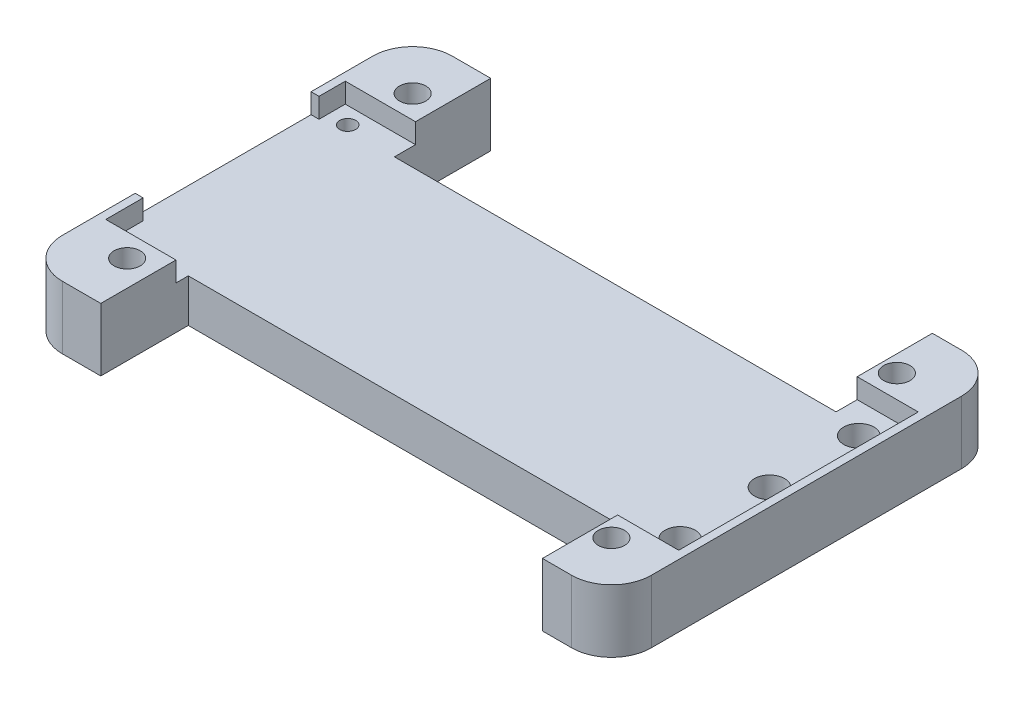
ISO-10303-21;
HEADER;
FILE_DESCRIPTION(('STEP AP214'),'2;1');
FILE_NAME('part.step','',(''),(''),'','','');
FILE_SCHEMA(('AUTOMOTIVE_DESIGN { 1 0 10303 214 1 1 1 1 }'));
ENDSEC;
DATA;
#1=APPLICATION_CONTEXT('core data for automotive mechanical design processes');
#2=APPLICATION_PROTOCOL_DEFINITION('international standard','automotive_design',2000,#1);
#3=PRODUCT_CONTEXT('',#1,'mechanical');
#4=PRODUCT('Part','Part','',(#3));
#5=PRODUCT_RELATED_PRODUCT_CATEGORY('part','',(#4));
#6=PRODUCT_DEFINITION_FORMATION('','',#4);
#7=PRODUCT_DEFINITION_CONTEXT('part definition',#1,'design');
#8=PRODUCT_DEFINITION('design','',#6,#7);
#9=PRODUCT_DEFINITION_SHAPE('','',#8);
#10=(LENGTH_UNIT() NAMED_UNIT(*) SI_UNIT(.MILLI.,.METRE.));
#11=(NAMED_UNIT(*) PLANE_ANGLE_UNIT() SI_UNIT($,.RADIAN.));
#12=(NAMED_UNIT(*) SI_UNIT($,.STERADIAN.) SOLID_ANGLE_UNIT());
#13=UNCERTAINTY_MEASURE_WITH_UNIT(LENGTH_MEASURE(1.E-05),#10,'distance_accuracy_value','');
#14=(GEOMETRIC_REPRESENTATION_CONTEXT(3) GLOBAL_UNCERTAINTY_ASSIGNED_CONTEXT((#13)) GLOBAL_UNIT_ASSIGNED_CONTEXT((#10,
#11,#12)) REPRESENTATION_CONTEXT('',''));
#15=CARTESIAN_POINT('',(0.,0.,0.));
#16=DIRECTION('',(0.,0.,1.));
#17=DIRECTION('',(1.,0.,0.));
#18=AXIS2_PLACEMENT_3D('',#15,#16,#17);
#19=CARTESIAN_POINT('',(-37.,7.9,24.5));
#20=DIRECTION('',(0.,0.,-1.));
#21=DIRECTION('',(-1.,0.,0.));
#22=AXIS2_PLACEMENT_3D('',#19,#20,#21);
#23=PLANE('',#22);
#24=DIRECTION('',(1.,0.,0.));
#25=VECTOR('',#24,1.);
#26=CARTESIAN_POINT('',(-37.,7.9,24.5));
#27=LINE('',#26,#25);
#28=CARTESIAN_POINT('',(28.324,7.9,24.5));
#29=VERTEX_POINT('',#28);
#30=CARTESIAN_POINT('',(32.,7.9,24.5));
#31=VERTEX_POINT('',#30);
#32=EDGE_CURVE('E261',#29,#31,#27,.T.);
#33=ORIENTED_EDGE('',*,*,#32,.F.);
#34=DIRECTION('',(0.,1.,0.));
#35=VECTOR('',#34,1.);
#36=CARTESIAN_POINT('',(28.324,-2.1,24.5));
#37=LINE('',#36,#35);
#38=CARTESIAN_POINT('',(28.324,0.,24.5));
#39=VERTEX_POINT('',#38);
#40=EDGE_CURVE('E254',#39,#29,#37,.T.);
#41=ORIENTED_EDGE('',*,*,#40,.F.);
#42=DIRECTION('',(1.,0.,0.));
#43=VECTOR('',#42,1.);
#44=CARTESIAN_POINT('',(-37.,0.,24.5));
#45=LINE('',#44,#43);
#46=CARTESIAN_POINT('',(32.,0.,24.5));
#47=VERTEX_POINT('',#46);
#48=EDGE_CURVE('E285',#39,#47,#45,.T.);
#49=ORIENTED_EDGE('',*,*,#48,.T.);
#50=DIRECTION('',(0.,-1.,0.));
#51=VECTOR('',#50,1.);
#52=CARTESIAN_POINT('',(32.,7.9,24.5));
#53=LINE('',#52,#51);
#54=EDGE_CURVE('E309',#47,#31,#53,.F.);
#55=ORIENTED_EDGE('',*,*,#54,.T.);
#56=EDGE_LOOP('',(#33,#41,#49,#55));
#57=FACE_BOUND('',#56,.T.);
#58=ADVANCED_FACE('F45',(#57),#23,.F.);
#59=CARTESIAN_POINT('',(0.,7.9,0.));
#60=DIRECTION('',(0.,-1.,0.));
#61=DIRECTION('',(0.,0.,-1.));
#62=AXIS2_PLACEMENT_3D('',#59,#60,#61);
#63=PLANE('',#62);
#64=CARTESIAN_POINT('',(30.424,7.9,17.9375));
#65=DIRECTION('',(0.,1.,0.));
#66=DIRECTION('',(0.,0.,1.));
#67=AXIS2_PLACEMENT_3D('',#64,#65,#66);
#68=CIRCLE('',#67,1.65);
#69=CARTESIAN_POINT('',(30.424,7.9,19.5875));
#70=VERTEX_POINT('',#69);
#71=EDGE_CURVE('E468',#70,#70,#68,.T.);
#72=ORIENTED_EDGE('',*,*,#71,.F.);
#73=EDGE_LOOP('',(#72));
#74=FACE_BOUND('',#73,.T.);
#75=CARTESIAN_POINT('',(30.424,7.9,-17.9375));
#76=DIRECTION('',(0.,1.,0.));
#77=DIRECTION('',(0.,0.,1.));
#78=AXIS2_PLACEMENT_3D('',#75,#76,#77);
#79=CIRCLE('',#78,1.65);
#80=CARTESIAN_POINT('',(30.424,7.9,-16.2875));
#81=VERTEX_POINT('',#80);
#82=EDGE_CURVE('E476',#81,#81,#79,.T.);
#83=ORIENTED_EDGE('',*,*,#82,.F.);
#84=EDGE_LOOP('',(#83));
#85=FACE_BOUND('',#84,.T.);
#86=DIRECTION('',(0.,0.,-1.));
#87=VECTOR('',#86,1.);
#88=CARTESIAN_POINT('',(28.324,7.9,13.5));
#89=LINE('',#88,#87);
#90=CARTESIAN_POINT('',(28.324,7.9,15.05));
#91=VERTEX_POINT('',#90);
#92=EDGE_CURVE('E61',#29,#91,#89,.T.);
#93=ORIENTED_EDGE('',*,*,#92,.F.);
#94=ORIENTED_EDGE('',*,*,#32,.T.);
#95=CARTESIAN_POINT('',(32.,7.9,19.5));
#96=DIRECTION('',(0.,-1.,0.));
#97=DIRECTION('',(0.,0.,-1.));
#98=AXIS2_PLACEMENT_3D('',#95,#96,#97);
#99=CIRCLE('',#98,5.);
#100=CARTESIAN_POINT('',(37.,7.9,19.5));
#101=VERTEX_POINT('',#100);
#102=EDGE_CURVE('E321',#31,#101,#99,.F.);
#103=ORIENTED_EDGE('',*,*,#102,.T.);
#104=DIRECTION('',(0.,0.,-1.));
#105=VECTOR('',#104,1.);
#106=CARTESIAN_POINT('',(37.,7.9,24.5));
#107=LINE('',#106,#105);
#108=CARTESIAN_POINT('',(37.,7.9,-19.5));
#109=VERTEX_POINT('',#108);
#110=EDGE_CURVE('E287',#101,#109,#107,.T.);
#111=ORIENTED_EDGE('',*,*,#110,.T.);
#112=CARTESIAN_POINT('',(32.,7.9,-19.5));
#113=DIRECTION('',(0.,-1.,0.));
#114=DIRECTION('',(0.,0.,-1.));
#115=AXIS2_PLACEMENT_3D('',#112,#113,#114);
#116=CIRCLE('',#115,5.);
#117=CARTESIAN_POINT('',(32.,7.9,-24.5));
#118=VERTEX_POINT('',#117);
#119=EDGE_CURVE('E318',#109,#118,#116,.F.);
#120=ORIENTED_EDGE('',*,*,#119,.T.);
#121=DIRECTION('',(-1.,0.,0.));
#122=VECTOR('',#121,1.);
#123=CARTESIAN_POINT('',(-37.,7.9,-24.5));
#124=LINE('',#123,#122);
#125=CARTESIAN_POINT('',(28.324,7.9,-24.5));
#126=VERTEX_POINT('',#125);
#127=EDGE_CURVE('E501',#118,#126,#124,.T.);
#128=ORIENTED_EDGE('',*,*,#127,.T.);
#129=DIRECTION('',(0.,0.,-1.));
#130=VECTOR('',#129,1.);
#131=CARTESIAN_POINT('',(28.324,7.9,-24.5));
#132=LINE('',#131,#130);
#133=CARTESIAN_POINT('',(28.324,7.9,-15.05));
#134=VERTEX_POINT('',#133);
#135=EDGE_CURVE('E584',#134,#126,#132,.T.);
#136=ORIENTED_EDGE('',*,*,#135,.F.);
#137=DIRECTION('',(-1.,0.,0.));
#138=VECTOR('',#137,1.);
#139=CARTESIAN_POINT('',(-36.,7.9,-15.05));
#140=LINE('',#139,#138);
#141=CARTESIAN_POINT('',(36.,7.9,-15.05));
#142=VERTEX_POINT('',#141);
#143=EDGE_CURVE('E387',#142,#134,#140,.T.);
#144=ORIENTED_EDGE('',*,*,#143,.F.);
#145=DIRECTION('',(0.,0.,-1.));
#146=VECTOR('',#145,1.);
#147=CARTESIAN_POINT('',(36.,7.9,-15.05));
#148=LINE('',#147,#146);
#149=CARTESIAN_POINT('',(36.,7.9,15.05));
#150=VERTEX_POINT('',#149);
#151=EDGE_CURVE('E410',#150,#142,#148,.T.);
#152=ORIENTED_EDGE('',*,*,#151,.F.);
#153=DIRECTION('',(1.,0.,0.));
#154=VECTOR('',#153,1.);
#155=CARTESIAN_POINT('',(-36.,7.9,15.05));
#156=LINE('',#155,#154);
#157=EDGE_CURVE('E407',#91,#150,#156,.T.);
#158=ORIENTED_EDGE('',*,*,#157,.F.);
#159=EDGE_LOOP('',(#93,#94,#103,#111,#120,#128,#136,#144,#152,#158));
#160=FACE_BOUND('',#159,.T.);
#161=ADVANCED_FACE('F633',(#74,#85,#160),#63,.F.);
#162=CARTESIAN_POINT('',(-36.,5.4,15.05));
#163=DIRECTION('',(0.,0.,1.));
#164=DIRECTION('',(1.,0.,0.));
#165=AXIS2_PLACEMENT_3D('',#162,#163,#164);
#166=PLANE('',#165);
#167=CARTESIAN_POINT('',(-36.,7.9,15.05));
#168=VERTEX_POINT('',#167);
#169=CARTESIAN_POINT('',(-27.176,7.9,15.05));
#170=VERTEX_POINT('',#169);
#171=EDGE_CURVE('E366',#168,#170,#156,.T.);
#172=ORIENTED_EDGE('',*,*,#171,.T.);
#173=DIRECTION('',(0.,-1.,0.));
#174=VECTOR('',#173,1.);
#175=CARTESIAN_POINT('',(-27.176,5.4,15.05));
#176=LINE('',#175,#174);
#177=CARTESIAN_POINT('',(-27.176,5.4,15.05));
#178=VERTEX_POINT('',#177);
#179=EDGE_CURVE('E54',#170,#178,#176,.T.);
#180=ORIENTED_EDGE('',*,*,#179,.T.);
#181=DIRECTION('',(1.,0.,0.));
#182=VECTOR('',#181,1.);
#183=CARTESIAN_POINT('',(-36.,5.4,15.05));
#184=LINE('',#183,#182);
#185=CARTESIAN_POINT('',(-36.,5.4,15.05));
#186=VERTEX_POINT('',#185);
#187=EDGE_CURVE('E364',#186,#178,#184,.T.);
#188=ORIENTED_EDGE('',*,*,#187,.F.);
#189=DIRECTION('',(0.,1.,0.));
#190=VECTOR('',#189,1.);
#191=CARTESIAN_POINT('',(-36.,5.4,15.05));
#192=LINE('',#191,#190);
#193=EDGE_CURVE('E421',#186,#168,#192,.T.);
#194=ORIENTED_EDGE('',*,*,#193,.T.);
#195=EDGE_LOOP('',(#172,#180,#188,#194));
#196=FACE_BOUND('',#195,.T.);
#197=ADVANCED_FACE('F363',(#196),#166,.F.);
#198=CARTESIAN_POINT('',(-37.,7.9,-24.5));
#199=DIRECTION('',(0.,0.,1.));
#200=DIRECTION('',(1.,0.,0.));
#201=AXIS2_PLACEMENT_3D('',#198,#199,#200);
#202=PLANE('',#201);
#203=CARTESIAN_POINT('',(-27.176,7.9,-24.5));
#204=VERTEX_POINT('',#203);
#205=CARTESIAN_POINT('',(-32.,7.9,-24.5));
#206=VERTEX_POINT('',#205);
#207=EDGE_CURVE('E500',#204,#206,#124,.T.);
#208=ORIENTED_EDGE('',*,*,#207,.F.);
#209=DIRECTION('',(0.,1.,0.));
#210=VECTOR('',#209,1.);
#211=CARTESIAN_POINT('',(-27.176,0.,-24.5));
#212=LINE('',#211,#210);
#213=CARTESIAN_POINT('',(-27.176,0.,-24.5));
#214=VERTEX_POINT('',#213);
#215=EDGE_CURVE('E569',#214,#204,#212,.T.);
#216=ORIENTED_EDGE('',*,*,#215,.F.);
#217=DIRECTION('',(-1.,0.,0.));
#218=VECTOR('',#217,1.);
#219=CARTESIAN_POINT('',(-37.,0.,-24.5));
#220=LINE('',#219,#218);
#221=CARTESIAN_POINT('',(-32.,0.,-24.5));
#222=VERTEX_POINT('',#221);
#223=EDGE_CURVE('E275',#214,#222,#220,.T.);
#224=ORIENTED_EDGE('',*,*,#223,.T.);
#225=DIRECTION('',(0.,-1.,0.));
#226=VECTOR('',#225,1.);
#227=CARTESIAN_POINT('',(-32.,7.9,-24.5));
#228=LINE('',#227,#226);
#229=EDGE_CURVE('E324',#222,#206,#228,.F.);
#230=ORIENTED_EDGE('',*,*,#229,.T.);
#231=EDGE_LOOP('',(#208,#216,#224,#230));
#232=FACE_BOUND('',#231,.T.);
#233=ADVANCED_FACE('F522',(#232),#202,.F.);
#234=CARTESIAN_POINT('',(-30.424,7.9,-17.9375));
#235=DIRECTION('',(0.,1.,0.));
#236=DIRECTION('',(0.,0.,1.));
#237=AXIS2_PLACEMENT_3D('',#234,#235,#236);
#238=CIRCLE('',#237,1.65);
#239=CARTESIAN_POINT('',(-30.424,7.9,-16.2875));
#240=VERTEX_POINT('',#239);
#241=EDGE_CURVE('E480',#240,#240,#238,.T.);
#242=ORIENTED_EDGE('',*,*,#241,.F.);
#243=EDGE_LOOP('',(#242));
#244=FACE_BOUND('',#243,.T.);
#245=CARTESIAN_POINT('',(-27.176,7.9,-15.05));
#246=VERTEX_POINT('',#245);
#247=CARTESIAN_POINT('',(-36.,7.9,-15.05));
#248=VERTEX_POINT('',#247);
#249=EDGE_CURVE('E392',#246,#248,#140,.T.);
#250=ORIENTED_EDGE('',*,*,#249,.F.);
#251=DIRECTION('',(0.,0.,1.));
#252=VECTOR('',#251,1.);
#253=CARTESIAN_POINT('',(-27.176,7.9,-24.5));
#254=LINE('',#253,#252);
#255=EDGE_CURVE('E518',#204,#246,#254,.T.);
#256=ORIENTED_EDGE('',*,*,#255,.F.);
#257=ORIENTED_EDGE('',*,*,#207,.T.);
#258=CARTESIAN_POINT('',(-32.,7.9,-19.5));
#259=DIRECTION('',(0.,-1.,0.));
#260=DIRECTION('',(0.,0.,-1.));
#261=AXIS2_PLACEMENT_3D('',#258,#259,#260);
#262=CIRCLE('',#261,5.);
#263=CARTESIAN_POINT('',(-37.,7.9,-19.5));
#264=VERTEX_POINT('',#263);
#265=EDGE_CURVE('E313',#206,#264,#262,.F.);
#266=ORIENTED_EDGE('',*,*,#265,.T.);
#267=DIRECTION('',(0.,0.,1.));
#268=VECTOR('',#267,1.);
#269=CARTESIAN_POINT('',(-37.,7.9,24.5));
#270=LINE('',#269,#268);
#271=CARTESIAN_POINT('',(-37.,7.9,-11.75));
#272=VERTEX_POINT('',#271);
#273=EDGE_CURVE('E267',#264,#272,#270,.T.);
#274=ORIENTED_EDGE('',*,*,#273,.T.);
#275=DIRECTION('',(-1.,0.,0.));
#276=VECTOR('',#275,1.);
#277=CARTESIAN_POINT('',(-36.,7.9,-11.75));
#278=LINE('',#277,#276);
#279=CARTESIAN_POINT('',(-36.,7.9,-11.75));
#280=VERTEX_POINT('',#279);
#281=EDGE_CURVE('E396',#280,#272,#278,.T.);
#282=ORIENTED_EDGE('',*,*,#281,.F.);
#283=DIRECTION('',(0.,0.,1.));
#284=VECTOR('',#283,1.);
#285=CARTESIAN_POINT('',(-36.,7.9,-15.05));
#286=LINE('',#285,#284);
#287=EDGE_CURVE('E391',#248,#280,#286,.T.);
#288=ORIENTED_EDGE('',*,*,#287,.F.);
#289=EDGE_LOOP('',(#250,#256,#257,#266,#274,#282,#288));
#290=FACE_BOUND('',#289,.T.);
#291=ADVANCED_FACE('F514',(#244,#290),#63,.F.);
#292=CARTESIAN_POINT('',(-36.,5.4,-15.05));
#293=DIRECTION('',(0.,0.,-1.));
#294=DIRECTION('',(-1.,0.,0.));
#295=AXIS2_PLACEMENT_3D('',#292,#293,#294);
#296=PLANE('',#295);
#297=DIRECTION('',(-1.,0.,0.));
#298=VECTOR('',#297,1.);
#299=CARTESIAN_POINT('',(-36.,5.4,-15.05));
#300=LINE('',#299,#298);
#301=CARTESIAN_POINT('',(-27.176,5.4,-15.05));
#302=VERTEX_POINT('',#301);
#303=CARTESIAN_POINT('',(-36.,5.4,-15.05));
#304=VERTEX_POINT('',#303);
#305=EDGE_CURVE('E414',#302,#304,#300,.T.);
#306=ORIENTED_EDGE('',*,*,#305,.F.);
#307=DIRECTION('',(0.,1.,0.));
#308=VECTOR('',#307,1.);
#309=CARTESIAN_POINT('',(-27.176,5.4,-15.05));
#310=LINE('',#309,#308);
#311=EDGE_CURVE('E349',#302,#246,#310,.T.);
#312=ORIENTED_EDGE('',*,*,#311,.T.);
#313=ORIENTED_EDGE('',*,*,#249,.T.);
#314=DIRECTION('',(0.,1.,0.));
#315=VECTOR('',#314,1.);
#316=CARTESIAN_POINT('',(-36.,5.4,-15.05));
#317=LINE('',#316,#315);
#318=EDGE_CURVE('E382',#304,#248,#317,.T.);
#319=ORIENTED_EDGE('',*,*,#318,.F.);
#320=EDGE_LOOP('',(#306,#312,#313,#319));
#321=FACE_BOUND('',#320,.T.);
#322=ADVANCED_FACE('F645',(#321),#296,.F.);
#323=CARTESIAN_POINT('',(37.,7.9,24.5));
#324=DIRECTION('',(-1.,0.,0.));
#325=DIRECTION('',(0.,0.,1.));
#326=AXIS2_PLACEMENT_3D('',#323,#324,#325);
#327=PLANE('',#326);
#328=ORIENTED_EDGE('',*,*,#110,.F.);
#329=DIRECTION('',(0.,-1.,0.));
#330=VECTOR('',#329,1.);
#331=CARTESIAN_POINT('',(37.,7.9,19.5));
#332=LINE('',#331,#330);
#333=CARTESIAN_POINT('',(37.,0.,19.5));
#334=VERTEX_POINT('',#333);
#335=EDGE_CURVE('E265',#101,#334,#332,.T.);
#336=ORIENTED_EDGE('',*,*,#335,.T.);
#337=DIRECTION('',(0.,0.,-1.));
#338=VECTOR('',#337,1.);
#339=CARTESIAN_POINT('',(37.,0.,24.5));
#340=LINE('',#339,#338);
#341=CARTESIAN_POINT('',(37.,0.,-19.5));
#342=VERTEX_POINT('',#341);
#343=EDGE_CURVE('E271',#334,#342,#340,.T.);
#344=ORIENTED_EDGE('',*,*,#343,.T.);
#345=DIRECTION('',(0.,-1.,0.));
#346=VECTOR('',#345,1.);
#347=CARTESIAN_POINT('',(37.,7.9,-19.5));
#348=LINE('',#347,#346);
#349=EDGE_CURVE('E260',#342,#109,#348,.F.);
#350=ORIENTED_EDGE('',*,*,#349,.T.);
#351=EDGE_LOOP('',(#328,#336,#344,#350));
#352=FACE_BOUND('',#351,.T.);
#353=ADVANCED_FACE('F667',(#352),#327,.F.);
#354=CARTESIAN_POINT('',(32.,0.,-24.5));
#355=VERTEX_POINT('',#354);
#356=CARTESIAN_POINT('',(28.324,0.,-24.5));
#357=VERTEX_POINT('',#356);
#358=EDGE_CURVE('E277',#355,#357,#220,.T.);
#359=ORIENTED_EDGE('',*,*,#358,.T.);
#360=DIRECTION('',(0.,1.,0.));
#361=VECTOR('',#360,1.);
#362=CARTESIAN_POINT('',(28.324,0.,-24.5));
#363=LINE('',#362,#361);
#364=EDGE_CURVE('E578',#357,#126,#363,.T.);
#365=ORIENTED_EDGE('',*,*,#364,.T.);
#366=ORIENTED_EDGE('',*,*,#127,.F.);
#367=DIRECTION('',(0.,-1.,0.));
#368=VECTOR('',#367,1.);
#369=CARTESIAN_POINT('',(32.,7.9,-24.5));
#370=LINE('',#369,#368);
#371=EDGE_CURVE('E328',#118,#355,#370,.T.);
#372=ORIENTED_EDGE('',*,*,#371,.T.);
#373=EDGE_LOOP('',(#359,#365,#366,#372));
#374=FACE_BOUND('',#373,.T.);
#375=ADVANCED_FACE('F675',(#374),#202,.F.);
#376=CARTESIAN_POINT('',(-37.,7.9,24.5));
#377=DIRECTION('',(1.,0.,0.));
#378=DIRECTION('',(0.,0.,-1.));
#379=AXIS2_PLACEMENT_3D('',#376,#377,#378);
#380=PLANE('',#379);
#381=CARTESIAN_POINT('',(-37.,7.9,10.35));
#382=VERTEX_POINT('',#381);
#383=CARTESIAN_POINT('',(-37.,7.9,19.5));
#384=VERTEX_POINT('',#383);
#385=EDGE_CURVE('E504',#382,#384,#270,.T.);
#386=ORIENTED_EDGE('',*,*,#385,.F.);
#387=DIRECTION('',(0.,1.,0.));
#388=VECTOR('',#387,1.);
#389=CARTESIAN_POINT('',(-37.,5.4,10.35));
#390=LINE('',#389,#388);
#391=CARTESIAN_POINT('',(-37.,5.4,10.35));
#392=VERTEX_POINT('',#391);
#393=EDGE_CURVE('E427',#392,#382,#390,.T.);
#394=ORIENTED_EDGE('',*,*,#393,.F.);
#395=DIRECTION('',(0.,0.,1.));
#396=VECTOR('',#395,1.);
#397=CARTESIAN_POINT('',(-37.,5.4,-11.75));
#398=LINE('',#397,#396);
#399=CARTESIAN_POINT('',(-37.,5.4,-11.75));
#400=VERTEX_POINT('',#399);
#401=EDGE_CURVE('E546',#400,#392,#398,.T.);
#402=ORIENTED_EDGE('',*,*,#401,.F.);
#403=DIRECTION('',(0.,1.,0.));
#404=VECTOR('',#403,1.);
#405=CARTESIAN_POINT('',(-37.,5.4,-11.75));
#406=LINE('',#405,#404);
#407=EDGE_CURVE('E430',#400,#272,#406,.T.);
#408=ORIENTED_EDGE('',*,*,#407,.T.);
#409=ORIENTED_EDGE('',*,*,#273,.F.);
#410=DIRECTION('',(0.,-1.,0.));
#411=VECTOR('',#410,1.);
#412=CARTESIAN_POINT('',(-37.,7.9,-19.5));
#413=LINE('',#412,#411);
#414=CARTESIAN_POINT('',(-37.,0.,-19.5));
#415=VERTEX_POINT('',#414);
#416=EDGE_CURVE('E332',#264,#415,#413,.T.);
#417=ORIENTED_EDGE('',*,*,#416,.T.);
#418=DIRECTION('',(0.,0.,1.));
#419=VECTOR('',#418,1.);
#420=CARTESIAN_POINT('',(-37.,0.,24.5));
#421=LINE('',#420,#419);
#422=CARTESIAN_POINT('',(-37.,0.,19.5));
#423=VERTEX_POINT('',#422);
#424=EDGE_CURVE('E281',#415,#423,#421,.T.);
#425=ORIENTED_EDGE('',*,*,#424,.T.);
#426=DIRECTION('',(0.,-1.,0.));
#427=VECTOR('',#426,1.);
#428=CARTESIAN_POINT('',(-37.,7.9,19.5));
#429=LINE('',#428,#427);
#430=EDGE_CURVE('E336',#423,#384,#429,.F.);
#431=ORIENTED_EDGE('',*,*,#430,.T.);
#432=EDGE_LOOP('',(#386,#394,#402,#408,#409,#417,#425,#431));
#433=FACE_BOUND('',#432,.T.);
#434=ADVANCED_FACE('F529',(#433),#380,.F.);
#435=CARTESIAN_POINT('',(-32.,0.,24.5));
#436=VERTEX_POINT('',#435);
#437=CARTESIAN_POINT('',(-27.176,0.,24.5));
#438=VERTEX_POINT('',#437);
#439=EDGE_CURVE('E252',#436,#438,#45,.T.);
#440=ORIENTED_EDGE('',*,*,#439,.T.);
#441=DIRECTION('',(0.,1.,0.));
#442=VECTOR('',#441,1.);
#443=CARTESIAN_POINT('',(-27.176,-2.1,24.5));
#444=LINE('',#443,#442);
#445=CARTESIAN_POINT('',(-27.176,7.9,24.5));
#446=VERTEX_POINT('',#445);
#447=EDGE_CURVE('E235',#438,#446,#444,.T.);
#448=ORIENTED_EDGE('',*,*,#447,.T.);
#449=CARTESIAN_POINT('',(-32.,7.9,24.5));
#450=VERTEX_POINT('',#449);
#451=EDGE_CURVE('E249',#450,#446,#27,.T.);
#452=ORIENTED_EDGE('',*,*,#451,.F.);
#453=DIRECTION('',(0.,-1.,0.));
#454=VECTOR('',#453,1.);
#455=CARTESIAN_POINT('',(-32.,7.9,24.5));
#456=LINE('',#455,#454);
#457=EDGE_CURVE('E306',#450,#436,#456,.T.);
#458=ORIENTED_EDGE('',*,*,#457,.T.);
#459=EDGE_LOOP('',(#440,#448,#452,#458));
#460=FACE_BOUND('',#459,.T.);
#461=ADVANCED_FACE('F247',(#460),#23,.F.);
#462=CARTESIAN_POINT('',(-30.424,7.9,17.9375));
#463=DIRECTION('',(0.,1.,0.));
#464=DIRECTION('',(0.,0.,1.));
#465=AXIS2_PLACEMENT_3D('',#462,#463,#464);
#466=CIRCLE('',#465,1.65);
#467=CARTESIAN_POINT('',(-30.424,7.9,19.5875));
#468=VERTEX_POINT('',#467);
#469=EDGE_CURVE('E485',#468,#468,#466,.T.);
#470=ORIENTED_EDGE('',*,*,#469,.F.);
#471=EDGE_LOOP('',(#470));
#472=FACE_BOUND('',#471,.T.);
#473=ORIENTED_EDGE('',*,*,#451,.T.);
#474=DIRECTION('',(0.,0.,1.));
#475=VECTOR('',#474,1.);
#476=CARTESIAN_POINT('',(-27.176,7.9,15.05));
#477=LINE('',#476,#475);
#478=EDGE_CURVE('E232',#170,#446,#477,.T.);
#479=ORIENTED_EDGE('',*,*,#478,.F.);
#480=ORIENTED_EDGE('',*,*,#171,.F.);
#481=DIRECTION('',(0.,0.,1.));
#482=VECTOR('',#481,1.);
#483=CARTESIAN_POINT('',(-36.,7.9,10.35));
#484=LINE('',#483,#482);
#485=CARTESIAN_POINT('',(-36.,7.9,10.35));
#486=VERTEX_POINT('',#485);
#487=EDGE_CURVE('E403',#486,#168,#484,.T.);
#488=ORIENTED_EDGE('',*,*,#487,.F.);
#489=DIRECTION('',(1.,0.,0.));
#490=VECTOR('',#489,1.);
#491=CARTESIAN_POINT('',(-37.,7.9,10.35));
#492=LINE('',#491,#490);
#493=EDGE_CURVE('E399',#382,#486,#492,.T.);
#494=ORIENTED_EDGE('',*,*,#493,.F.);
#495=ORIENTED_EDGE('',*,*,#385,.T.);
#496=CARTESIAN_POINT('',(-32.,7.9,19.5));
#497=DIRECTION('',(0.,-1.,0.));
#498=DIRECTION('',(0.,0.,-1.));
#499=AXIS2_PLACEMENT_3D('',#496,#497,#498);
#500=CIRCLE('',#499,5.);
#501=EDGE_CURVE('E258',#384,#450,#500,.F.);
#502=ORIENTED_EDGE('',*,*,#501,.T.);
#503=EDGE_LOOP('',(#473,#479,#480,#488,#494,#495,#502));
#504=FACE_BOUND('',#503,.T.);
#505=ADVANCED_FACE('F256',(#472,#504),#63,.F.);
#506=CARTESIAN_POINT('',(0.,0.,0.));
#507=DIRECTION('',(0.,-1.,0.));
#508=DIRECTION('',(0.,0.,-1.));
#509=AXIS2_PLACEMENT_3D('',#506,#507,#508);
#510=PLANE('',#509);
#511=ORIENTED_EDGE('',*,*,#48,.F.);
#512=DIRECTION('',(0.,0.,-1.));
#513=VECTOR('',#512,1.);
#514=CARTESIAN_POINT('',(28.324,0.,21.5));
#515=LINE('',#514,#513);
#516=CARTESIAN_POINT('',(28.324,0.,13.5));
#517=VERTEX_POINT('',#516);
#518=EDGE_CURVE('E620',#39,#517,#515,.T.);
#519=ORIENTED_EDGE('',*,*,#518,.T.);
#520=DIRECTION('',(-1.,0.,0.));
#521=VECTOR('',#520,1.);
#522=CARTESIAN_POINT('',(-27.176,0.,13.5));
#523=LINE('',#522,#521);
#524=CARTESIAN_POINT('',(-27.176,0.,13.5));
#525=VERTEX_POINT('',#524);
#526=EDGE_CURVE('E611',#517,#525,#523,.T.);
#527=ORIENTED_EDGE('',*,*,#526,.T.);
#528=DIRECTION('',(0.,0.,1.));
#529=VECTOR('',#528,1.);
#530=CARTESIAN_POINT('',(-27.176,0.,15.05));
#531=LINE('',#530,#529);
#532=EDGE_CURVE('E243',#525,#438,#531,.T.);
#533=ORIENTED_EDGE('',*,*,#532,.T.);
#534=ORIENTED_EDGE('',*,*,#439,.F.);
#535=CARTESIAN_POINT('',(-32.,0.,19.5));
#536=DIRECTION('',(0.,-1.,0.));
#537=DIRECTION('',(0.,0.,-1.));
#538=AXIS2_PLACEMENT_3D('',#535,#536,#537);
#539=CIRCLE('',#538,5.);
#540=EDGE_CURVE('E296',#436,#423,#539,.T.);
#541=ORIENTED_EDGE('',*,*,#540,.T.);
#542=ORIENTED_EDGE('',*,*,#424,.F.);
#543=CARTESIAN_POINT('',(-32.,0.,-19.5));
#544=DIRECTION('',(0.,-1.,0.));
#545=DIRECTION('',(0.,0.,-1.));
#546=AXIS2_PLACEMENT_3D('',#543,#544,#545);
#547=CIRCLE('',#546,5.);
#548=EDGE_CURVE('E292',#415,#222,#547,.T.);
#549=ORIENTED_EDGE('',*,*,#548,.T.);
#550=ORIENTED_EDGE('',*,*,#223,.F.);
#551=DIRECTION('',(0.,0.,1.));
#552=VECTOR('',#551,1.);
#553=CARTESIAN_POINT('',(-27.176,0.,-24.5));
#554=LINE('',#553,#552);
#555=CARTESIAN_POINT('',(-27.176,0.,-12.4));
#556=VERTEX_POINT('',#555);
#557=EDGE_CURVE('E587',#214,#556,#554,.T.);
#558=ORIENTED_EDGE('',*,*,#557,.T.);
#559=DIRECTION('',(1.,0.,0.));
#560=VECTOR('',#559,1.);
#561=CARTESIAN_POINT('',(-27.176,0.,-12.4));
#562=LINE('',#561,#560);
#563=CARTESIAN_POINT('',(28.324,0.,-12.4));
#564=VERTEX_POINT('',#563);
#565=EDGE_CURVE('E593',#556,#564,#562,.T.);
#566=ORIENTED_EDGE('',*,*,#565,.T.);
#567=DIRECTION('',(0.,0.,-1.));
#568=VECTOR('',#567,1.);
#569=CARTESIAN_POINT('',(28.324,0.,-24.5));
#570=LINE('',#569,#568);
#571=EDGE_CURVE('E575',#564,#357,#570,.T.);
#572=ORIENTED_EDGE('',*,*,#571,.T.);
#573=ORIENTED_EDGE('',*,*,#358,.F.);
#574=CARTESIAN_POINT('',(32.,0.,-19.5));
#575=DIRECTION('',(0.,-1.,0.));
#576=DIRECTION('',(0.,0.,-1.));
#577=AXIS2_PLACEMENT_3D('',#574,#575,#576);
#578=CIRCLE('',#577,5.);
#579=EDGE_CURVE('E299',#355,#342,#578,.T.);
#580=ORIENTED_EDGE('',*,*,#579,.T.);
#581=ORIENTED_EDGE('',*,*,#343,.F.);
#582=CARTESIAN_POINT('',(32.,0.,19.5));
#583=DIRECTION('',(0.,-1.,0.));
#584=DIRECTION('',(0.,0.,-1.));
#585=AXIS2_PLACEMENT_3D('',#582,#583,#584);
#586=CIRCLE('',#585,5.);
#587=EDGE_CURVE('E302',#334,#47,#586,.T.);
#588=ORIENTED_EDGE('',*,*,#587,.T.);
#589=EDGE_LOOP('',(#511,#519,#527,#533,#534,#541,#542,#549,#550,#558,#566,#572,#573,#580,#581,#588));
#590=FACE_BOUND('',#589,.T.);
#591=CARTESIAN_POINT('',(-33.584,0.,-12.9375));
#592=DIRECTION('',(0.,1.,0.));
#593=DIRECTION('',(0.,0.,1.));
#594=AXIS2_PLACEMENT_3D('',#591,#592,#593);
#595=CIRCLE('',#594,0.999999999999998);
#596=CARTESIAN_POINT('',(-33.584,0.,-11.9375));
#597=VERTEX_POINT('',#596);
#598=EDGE_CURVE('E451',#597,#597,#595,.T.);
#599=ORIENTED_EDGE('',*,*,#598,.T.);
#600=EDGE_LOOP('',(#599));
#601=FACE_BOUND('',#600,.T.);
#602=CARTESIAN_POINT('',(32.354,0.,11.2275));
#603=DIRECTION('',(0.,1.,0.));
#604=DIRECTION('',(0.,0.,1.));
#605=AXIS2_PLACEMENT_3D('',#602,#603,#604);
#606=CIRCLE('',#605,1.9);
#607=CARTESIAN_POINT('',(32.354,0.,13.1275));
#608=VERTEX_POINT('',#607);
#609=EDGE_CURVE('E457',#608,#608,#606,.T.);
#610=ORIENTED_EDGE('',*,*,#609,.T.);
#611=EDGE_LOOP('',(#610));
#612=FACE_BOUND('',#611,.T.);
#613=CARTESIAN_POINT('',(32.354,0.,-0.00249999999999903));
#614=DIRECTION('',(0.,1.,0.));
#615=DIRECTION('',(0.,0.,1.));
#616=AXIS2_PLACEMENT_3D('',#613,#614,#615);
#617=CIRCLE('',#616,1.9);
#618=CARTESIAN_POINT('',(32.354,0.,1.8975));
#619=VERTEX_POINT('',#618);
#620=EDGE_CURVE('E452',#619,#619,#617,.T.);
#621=ORIENTED_EDGE('',*,*,#620,.T.);
#622=EDGE_LOOP('',(#621));
#623=FACE_BOUND('',#622,.T.);
#624=CARTESIAN_POINT('',(32.354,0.,-11.2275));
#625=DIRECTION('',(0.,1.,0.));
#626=DIRECTION('',(0.,0.,1.));
#627=AXIS2_PLACEMENT_3D('',#624,#625,#626);
#628=CIRCLE('',#627,1.9);
#629=CARTESIAN_POINT('',(32.354,0.,-9.32749999999999));
#630=VERTEX_POINT('',#629);
#631=EDGE_CURVE('E456',#630,#630,#628,.T.);
#632=ORIENTED_EDGE('',*,*,#631,.T.);
#633=EDGE_LOOP('',(#632));
#634=FACE_BOUND('',#633,.T.);
#635=CARTESIAN_POINT('',(30.424,0.,-17.9375));
#636=DIRECTION('',(0.,1.,0.));
#637=DIRECTION('',(0.,0.,1.));
#638=AXIS2_PLACEMENT_3D('',#635,#636,#637);
#639=CIRCLE('',#638,1.65);
#640=CARTESIAN_POINT('',(30.424,0.,-16.2875));
#641=VERTEX_POINT('',#640);
#642=EDGE_CURVE('E481',#641,#641,#639,.T.);
#643=ORIENTED_EDGE('',*,*,#642,.T.);
#644=EDGE_LOOP('',(#643));
#645=FACE_BOUND('',#644,.T.);
#646=CARTESIAN_POINT('',(-30.424,0.,17.9375));
#647=DIRECTION('',(0.,1.,0.));
#648=DIRECTION('',(0.,0.,1.));
#649=AXIS2_PLACEMENT_3D('',#646,#647,#648);
#650=CIRCLE('',#649,1.65);
#651=CARTESIAN_POINT('',(-30.424,0.,19.5875));
#652=VERTEX_POINT('',#651);
#653=EDGE_CURVE('E472',#652,#652,#650,.T.);
#654=ORIENTED_EDGE('',*,*,#653,.T.);
#655=EDGE_LOOP('',(#654));
#656=FACE_BOUND('',#655,.T.);
#657=CARTESIAN_POINT('',(30.424,0.,17.9375));
#658=DIRECTION('',(0.,1.,0.));
#659=DIRECTION('',(0.,0.,1.));
#660=AXIS2_PLACEMENT_3D('',#657,#658,#659);
#661=CIRCLE('',#660,1.65);
#662=CARTESIAN_POINT('',(30.424,0.,19.5875));
#663=VERTEX_POINT('',#662);
#664=EDGE_CURVE('E467',#663,#663,#661,.T.);
#665=ORIENTED_EDGE('',*,*,#664,.T.);
#666=EDGE_LOOP('',(#665));
#667=FACE_BOUND('',#666,.T.);
#668=CARTESIAN_POINT('',(-30.424,0.,-17.9375));
#669=DIRECTION('',(0.,1.,0.));
#670=DIRECTION('',(0.,0.,1.));
#671=AXIS2_PLACEMENT_3D('',#668,#669,#670);
#672=CIRCLE('',#671,1.65);
#673=CARTESIAN_POINT('',(-30.424,0.,-16.2875));
#674=VERTEX_POINT('',#673);
#675=EDGE_CURVE('E276',#674,#674,#672,.T.);
#676=ORIENTED_EDGE('',*,*,#675,.T.);
#677=EDGE_LOOP('',(#676));
#678=FACE_BOUND('',#677,.T.);
#679=ADVANCED_FACE('F533',(#590,#601,#612,#623,#634,#645,#656,#667,#678),#510,.T.);
#680=CARTESIAN_POINT('',(32.,7.9,19.5));
#681=DIRECTION('',(0.,-1.,0.));
#682=DIRECTION('',(0.,0.,-1.));
#683=AXIS2_PLACEMENT_3D('',#680,#681,#682);
#684=CYLINDRICAL_SURFACE('',#683,5.);
#685=ORIENTED_EDGE('',*,*,#102,.F.);
#686=ORIENTED_EDGE('',*,*,#54,.F.);
#687=ORIENTED_EDGE('',*,*,#587,.F.);
#688=ORIENTED_EDGE('',*,*,#335,.F.);
#689=EDGE_LOOP('',(#685,#686,#687,#688));
#690=FACE_BOUND('',#689,.T.);
#691=ADVANCED_FACE('F665',(#690),#684,.T.);
#692=CARTESIAN_POINT('',(32.,7.9,-19.5));
#693=DIRECTION('',(0.,-1.,0.));
#694=DIRECTION('',(0.,0.,-1.));
#695=AXIS2_PLACEMENT_3D('',#692,#693,#694);
#696=CYLINDRICAL_SURFACE('',#695,5.);
#697=ORIENTED_EDGE('',*,*,#119,.F.);
#698=ORIENTED_EDGE('',*,*,#349,.F.);
#699=ORIENTED_EDGE('',*,*,#579,.F.);
#700=ORIENTED_EDGE('',*,*,#371,.F.);
#701=EDGE_LOOP('',(#697,#698,#699,#700));
#702=FACE_BOUND('',#701,.T.);
#703=ADVANCED_FACE('F672',(#702),#696,.T.);
#704=CARTESIAN_POINT('',(-32.,7.9,19.5));
#705=DIRECTION('',(0.,-1.,0.));
#706=DIRECTION('',(0.,0.,-1.));
#707=AXIS2_PLACEMENT_3D('',#704,#705,#706);
#708=CYLINDRICAL_SURFACE('',#707,5.);
#709=ORIENTED_EDGE('',*,*,#501,.F.);
#710=ORIENTED_EDGE('',*,*,#430,.F.);
#711=ORIENTED_EDGE('',*,*,#540,.F.);
#712=ORIENTED_EDGE('',*,*,#457,.F.);
#713=EDGE_LOOP('',(#709,#710,#711,#712));
#714=FACE_BOUND('',#713,.T.);
#715=ADVANCED_FACE('F536',(#714),#708,.T.);
#716=CARTESIAN_POINT('',(-32.,7.9,-19.5));
#717=DIRECTION('',(0.,-1.,0.));
#718=DIRECTION('',(0.,0.,-1.));
#719=AXIS2_PLACEMENT_3D('',#716,#717,#718);
#720=CYLINDRICAL_SURFACE('',#719,5.);
#721=ORIENTED_EDGE('',*,*,#265,.F.);
#722=ORIENTED_EDGE('',*,*,#229,.F.);
#723=ORIENTED_EDGE('',*,*,#548,.F.);
#724=ORIENTED_EDGE('',*,*,#416,.F.);
#725=EDGE_LOOP('',(#721,#722,#723,#724));
#726=FACE_BOUND('',#725,.T.);
#727=ADVANCED_FACE('F47',(#726),#720,.T.);
#728=CARTESIAN_POINT('',(-30.424,0.,-17.9375));
#729=DIRECTION('',(0.,1.,0.));
#730=DIRECTION('',(0.,0.,1.));
#731=AXIS2_PLACEMENT_3D('',#728,#729,#730);
#732=CYLINDRICAL_SURFACE('',#731,1.65);
#733=ORIENTED_EDGE('',*,*,#675,.F.);
#734=EDGE_LOOP('',(#733));
#735=FACE_BOUND('',#734,.T.);
#736=ORIENTED_EDGE('',*,*,#241,.T.);
#737=EDGE_LOOP('',(#736));
#738=FACE_BOUND('',#737,.T.);
#739=ADVANCED_FACE('F727',(#735,#738),#732,.F.);
#740=CARTESIAN_POINT('',(30.424,0.,17.9375));
#741=DIRECTION('',(0.,1.,0.));
#742=DIRECTION('',(0.,0.,1.));
#743=AXIS2_PLACEMENT_3D('',#740,#741,#742);
#744=CYLINDRICAL_SURFACE('',#743,1.65);
#745=ORIENTED_EDGE('',*,*,#664,.F.);
#746=EDGE_LOOP('',(#745));
#747=FACE_BOUND('',#746,.T.);
#748=ORIENTED_EDGE('',*,*,#71,.T.);
#749=EDGE_LOOP('',(#748));
#750=FACE_BOUND('',#749,.T.);
#751=ADVANCED_FACE('F731',(#747,#750),#744,.F.);
#752=CARTESIAN_POINT('',(-30.424,0.,17.9375));
#753=DIRECTION('',(0.,1.,0.));
#754=DIRECTION('',(0.,0.,1.));
#755=AXIS2_PLACEMENT_3D('',#752,#753,#754);
#756=CYLINDRICAL_SURFACE('',#755,1.65);
#757=ORIENTED_EDGE('',*,*,#653,.F.);
#758=EDGE_LOOP('',(#757));
#759=FACE_BOUND('',#758,.T.);
#760=ORIENTED_EDGE('',*,*,#469,.T.);
#761=EDGE_LOOP('',(#760));
#762=FACE_BOUND('',#761,.T.);
#763=ADVANCED_FACE('F737',(#759,#762),#756,.F.);
#764=CARTESIAN_POINT('',(30.424,0.,-17.9375));
#765=DIRECTION('',(0.,1.,0.));
#766=DIRECTION('',(0.,0.,1.));
#767=AXIS2_PLACEMENT_3D('',#764,#765,#766);
#768=CYLINDRICAL_SURFACE('',#767,1.65);
#769=ORIENTED_EDGE('',*,*,#642,.F.);
#770=EDGE_LOOP('',(#769));
#771=FACE_BOUND('',#770,.T.);
#772=ORIENTED_EDGE('',*,*,#82,.T.);
#773=EDGE_LOOP('',(#772));
#774=FACE_BOUND('',#773,.T.);
#775=ADVANCED_FACE('F791',(#771,#774),#768,.F.);
#776=CARTESIAN_POINT('',(32.354,0.,-11.2275));
#777=DIRECTION('',(0.,1.,0.));
#778=DIRECTION('',(0.,0.,1.));
#779=AXIS2_PLACEMENT_3D('',#776,#777,#778);
#780=CYLINDRICAL_SURFACE('',#779,1.9);
#781=CARTESIAN_POINT('',(32.354,5.4,-11.2275));
#782=DIRECTION('',(0.,-1.,0.));
#783=DIRECTION('',(0.,0.,-1.));
#784=AXIS2_PLACEMENT_3D('',#781,#782,#783);
#785=CIRCLE('',#784,1.9);
#786=CARTESIAN_POINT('',(32.354,5.4,-13.1275));
#787=VERTEX_POINT('',#786);
#788=EDGE_CURVE('E447',#787,#787,#785,.F.);
#789=ORIENTED_EDGE('',*,*,#788,.T.);
#790=EDGE_LOOP('',(#789));
#791=FACE_BOUND('',#790,.T.);
#792=ORIENTED_EDGE('',*,*,#631,.F.);
#793=EDGE_LOOP('',(#792));
#794=FACE_BOUND('',#793,.T.);
#795=ADVANCED_FACE('F800',(#791,#794),#780,.F.);
#796=CARTESIAN_POINT('',(32.354,0.,-0.00249999999999903));
#797=DIRECTION('',(0.,1.,0.));
#798=DIRECTION('',(0.,0.,1.));
#799=AXIS2_PLACEMENT_3D('',#796,#797,#798);
#800=CYLINDRICAL_SURFACE('',#799,1.9);
#801=CARTESIAN_POINT('',(32.354,5.4,-0.00249999999999903));
#802=DIRECTION('',(0.,-1.,0.));
#803=DIRECTION('',(0.,0.,-1.));
#804=AXIS2_PLACEMENT_3D('',#801,#802,#803);
#805=CIRCLE('',#804,1.9);
#806=CARTESIAN_POINT('',(32.354,5.4,-1.9025));
#807=VERTEX_POINT('',#806);
#808=EDGE_CURVE('E443',#807,#807,#805,.F.);
#809=ORIENTED_EDGE('',*,*,#808,.T.);
#810=EDGE_LOOP('',(#809));
#811=FACE_BOUND('',#810,.T.);
#812=ORIENTED_EDGE('',*,*,#620,.F.);
#813=EDGE_LOOP('',(#812));
#814=FACE_BOUND('',#813,.T.);
#815=ADVANCED_FACE('F818',(#811,#814),#800,.F.);
#816=CARTESIAN_POINT('',(32.354,0.,11.2275));
#817=DIRECTION('',(0.,1.,0.));
#818=DIRECTION('',(0.,0.,1.));
#819=AXIS2_PLACEMENT_3D('',#816,#817,#818);
#820=CYLINDRICAL_SURFACE('',#819,1.9);
#821=CARTESIAN_POINT('',(32.354,5.4,11.2275));
#822=DIRECTION('',(0.,-1.,0.));
#823=DIRECTION('',(0.,0.,-1.));
#824=AXIS2_PLACEMENT_3D('',#821,#822,#823);
#825=CIRCLE('',#824,1.9);
#826=CARTESIAN_POINT('',(32.354,5.4,9.3275));
#827=VERTEX_POINT('',#826);
#828=EDGE_CURVE('E345',#827,#827,#825,.F.);
#829=ORIENTED_EDGE('',*,*,#828,.T.);
#830=EDGE_LOOP('',(#829));
#831=FACE_BOUND('',#830,.T.);
#832=ORIENTED_EDGE('',*,*,#609,.F.);
#833=EDGE_LOOP('',(#832));
#834=FACE_BOUND('',#833,.T.);
#835=ADVANCED_FACE('F829',(#831,#834),#820,.F.);
#836=CARTESIAN_POINT('',(-33.584,0.,-12.9375));
#837=DIRECTION('',(0.,1.,0.));
#838=DIRECTION('',(0.,0.,1.));
#839=AXIS2_PLACEMENT_3D('',#836,#837,#838);
#840=CYLINDRICAL_SURFACE('',#839,0.999999999999998);
#841=CARTESIAN_POINT('',(-33.584,5.4,-12.9375));
#842=DIRECTION('',(0.,-1.,0.));
#843=DIRECTION('',(0.,0.,-1.));
#844=AXIS2_PLACEMENT_3D('',#841,#842,#843);
#845=CIRCLE('',#844,0.999999999999998);
#846=CARTESIAN_POINT('',(-33.584,5.4,-13.9375));
#847=VERTEX_POINT('',#846);
#848=EDGE_CURVE('E341',#847,#847,#845,.F.);
#849=ORIENTED_EDGE('',*,*,#848,.T.);
#850=EDGE_LOOP('',(#849));
#851=FACE_BOUND('',#850,.T.);
#852=ORIENTED_EDGE('',*,*,#598,.F.);
#853=EDGE_LOOP('',(#852));
#854=FACE_BOUND('',#853,.T.);
#855=ADVANCED_FACE('F840',(#851,#854),#840,.F.);
#856=CARTESIAN_POINT('',(0.,5.4,0.));
#857=DIRECTION('',(0.,-1.,0.));
#858=DIRECTION('',(0.,0.,-1.));
#859=AXIS2_PLACEMENT_3D('',#856,#857,#858);
#860=PLANE('',#859);
#861=ORIENTED_EDGE('',*,*,#808,.F.);
#862=EDGE_LOOP('',(#861));
#863=FACE_BOUND('',#862,.T.);
#864=ORIENTED_EDGE('',*,*,#848,.F.);
#865=EDGE_LOOP('',(#864));
#866=FACE_BOUND('',#865,.T.);
#867=ORIENTED_EDGE('',*,*,#187,.T.);
#868=DIRECTION('',(0.,0.,-1.));
#869=VECTOR('',#868,1.);
#870=CARTESIAN_POINT('',(-27.176,5.4,0.));
#871=LINE('',#870,#869);
#872=CARTESIAN_POINT('',(-27.176,5.4,13.5));
#873=VERTEX_POINT('',#872);
#874=EDGE_CURVE('E371',#178,#873,#871,.T.);
#875=ORIENTED_EDGE('',*,*,#874,.T.);
#876=DIRECTION('',(1.,0.,0.));
#877=VECTOR('',#876,1.);
#878=CARTESIAN_POINT('',(0.,5.4,13.5));
#879=LINE('',#878,#877);
#880=CARTESIAN_POINT('',(28.324,5.4,13.5));
#881=VERTEX_POINT('',#880);
#882=EDGE_CURVE('E11',#873,#881,#879,.T.);
#883=ORIENTED_EDGE('',*,*,#882,.T.);
#884=DIRECTION('',(0.,0.,1.));
#885=VECTOR('',#884,1.);
#886=CARTESIAN_POINT('',(28.324,5.4,0.));
#887=LINE('',#886,#885);
#888=CARTESIAN_POINT('',(28.324,5.4,15.05));
#889=VERTEX_POINT('',#888);
#890=EDGE_CURVE('E602',#881,#889,#887,.T.);
#891=ORIENTED_EDGE('',*,*,#890,.T.);
#892=CARTESIAN_POINT('',(36.,5.4,15.05));
#893=VERTEX_POINT('',#892);
#894=EDGE_CURVE('E377',#889,#893,#184,.T.);
#895=ORIENTED_EDGE('',*,*,#894,.T.);
#896=DIRECTION('',(0.,0.,-1.));
#897=VECTOR('',#896,1.);
#898=CARTESIAN_POINT('',(36.,5.4,-15.05));
#899=LINE('',#898,#897);
#900=CARTESIAN_POINT('',(36.,5.4,-15.05));
#901=VERTEX_POINT('',#900);
#902=EDGE_CURVE('E376',#893,#901,#899,.T.);
#903=ORIENTED_EDGE('',*,*,#902,.T.);
#904=CARTESIAN_POINT('',(28.324,5.4,-15.05));
#905=VERTEX_POINT('',#904);
#906=EDGE_CURVE('E559',#901,#905,#300,.T.);
#907=ORIENTED_EDGE('',*,*,#906,.T.);
#908=DIRECTION('',(0.,0.,1.));
#909=VECTOR('',#908,1.);
#910=CARTESIAN_POINT('',(28.324,5.4,0.));
#911=LINE('',#910,#909);
#912=CARTESIAN_POINT('',(28.324,5.4,-12.4));
#913=VERTEX_POINT('',#912);
#914=EDGE_CURVE('E69',#905,#913,#911,.T.);
#915=ORIENTED_EDGE('',*,*,#914,.T.);
#916=DIRECTION('',(-1.,0.,0.));
#917=VECTOR('',#916,1.);
#918=CARTESIAN_POINT('',(0.,5.4,-12.4));
#919=LINE('',#918,#917);
#920=CARTESIAN_POINT('',(-27.176,5.4,-12.4));
#921=VERTEX_POINT('',#920);
#922=EDGE_CURVE('E353',#913,#921,#919,.T.);
#923=ORIENTED_EDGE('',*,*,#922,.T.);
#924=DIRECTION('',(0.,0.,-1.));
#925=VECTOR('',#924,1.);
#926=CARTESIAN_POINT('',(-27.176,5.4,0.));
#927=LINE('',#926,#925);
#928=EDGE_CURVE('E563',#921,#302,#927,.T.);
#929=ORIENTED_EDGE('',*,*,#928,.T.);
#930=ORIENTED_EDGE('',*,*,#305,.T.);
#931=DIRECTION('',(0.,0.,1.));
#932=VECTOR('',#931,1.);
#933=CARTESIAN_POINT('',(-36.,5.4,-15.05));
#934=LINE('',#933,#932);
#935=CARTESIAN_POINT('',(-36.,5.4,-11.75));
#936=VERTEX_POINT('',#935);
#937=EDGE_CURVE('E554',#304,#936,#934,.T.);
#938=ORIENTED_EDGE('',*,*,#937,.T.);
#939=DIRECTION('',(-1.,0.,0.));
#940=VECTOR('',#939,1.);
#941=CARTESIAN_POINT('',(-36.,5.4,-11.75));
#942=LINE('',#941,#940);
#943=EDGE_CURVE('E550',#936,#400,#942,.T.);
#944=ORIENTED_EDGE('',*,*,#943,.T.);
#945=ORIENTED_EDGE('',*,*,#401,.T.);
#946=DIRECTION('',(1.,0.,0.));
#947=VECTOR('',#946,1.);
#948=CARTESIAN_POINT('',(-37.,5.4,10.35));
#949=LINE('',#948,#947);
#950=CARTESIAN_POINT('',(-36.,5.4,10.35));
#951=VERTEX_POINT('',#950);
#952=EDGE_CURVE('E543',#392,#951,#949,.T.);
#953=ORIENTED_EDGE('',*,*,#952,.T.);
#954=DIRECTION('',(0.,0.,1.));
#955=VECTOR('',#954,1.);
#956=CARTESIAN_POINT('',(-36.,5.4,10.35));
#957=LINE('',#956,#955);
#958=EDGE_CURVE('E374',#951,#186,#957,.T.);
#959=ORIENTED_EDGE('',*,*,#958,.T.);
#960=EDGE_LOOP('',(#867,#875,#883,#891,#895,#903,#907,#915,#923,#929,#930,#938,#944,#945,#953,#959));
#961=FACE_BOUND('',#960,.T.);
#962=ORIENTED_EDGE('',*,*,#828,.F.);
#963=EDGE_LOOP('',(#962));
#964=FACE_BOUND('',#963,.T.);
#965=ORIENTED_EDGE('',*,*,#788,.F.);
#966=EDGE_LOOP('',(#965));
#967=FACE_BOUND('',#966,.T.);
#968=ADVANCED_FACE('F369',(#863,#866,#961,#964,#967),#860,.F.);
#969=ORIENTED_EDGE('',*,*,#143,.T.);
#970=DIRECTION('',(0.,-1.,0.));
#971=VECTOR('',#970,1.);
#972=CARTESIAN_POINT('',(28.324,5.4,-15.05));
#973=LINE('',#972,#971);
#974=EDGE_CURVE('E340',#134,#905,#973,.T.);
#975=ORIENTED_EDGE('',*,*,#974,.T.);
#976=ORIENTED_EDGE('',*,*,#906,.F.);
#977=DIRECTION('',(0.,1.,0.));
#978=VECTOR('',#977,1.);
#979=CARTESIAN_POINT('',(36.,5.4,-15.05));
#980=LINE('',#979,#978);
#981=EDGE_CURVE('E346',#901,#142,#980,.T.);
#982=ORIENTED_EDGE('',*,*,#981,.T.);
#983=EDGE_LOOP('',(#969,#975,#976,#982));
#984=FACE_BOUND('',#983,.T.);
#985=ADVANCED_FACE('F678',(#984),#296,.F.);
#986=CARTESIAN_POINT('',(36.,5.4,-15.05));
#987=DIRECTION('',(1.,0.,0.));
#988=DIRECTION('',(0.,0.,-1.));
#989=AXIS2_PLACEMENT_3D('',#986,#987,#988);
#990=PLANE('',#989);
#991=ORIENTED_EDGE('',*,*,#151,.T.);
#992=ORIENTED_EDGE('',*,*,#981,.F.);
#993=ORIENTED_EDGE('',*,*,#902,.F.);
#994=DIRECTION('',(0.,1.,0.));
#995=VECTOR('',#994,1.);
#996=CARTESIAN_POINT('',(36.,5.4,15.05));
#997=LINE('',#996,#995);
#998=EDGE_CURVE('E417',#893,#150,#997,.T.);
#999=ORIENTED_EDGE('',*,*,#998,.T.);
#1000=EDGE_LOOP('',(#991,#992,#993,#999));
#1001=FACE_BOUND('',#1000,.T.);
#1002=ADVANCED_FACE('F682',(#1001),#990,.F.);
#1003=ORIENTED_EDGE('',*,*,#894,.F.);
#1004=DIRECTION('',(0.,1.,0.));
#1005=VECTOR('',#1004,1.);
#1006=CARTESIAN_POINT('',(28.324,5.4,15.05));
#1007=LINE('',#1006,#1005);
#1008=EDGE_CURVE('E357',#889,#91,#1007,.T.);
#1009=ORIENTED_EDGE('',*,*,#1008,.T.);
#1010=ORIENTED_EDGE('',*,*,#157,.T.);
#1011=ORIENTED_EDGE('',*,*,#998,.F.);
#1012=EDGE_LOOP('',(#1003,#1009,#1010,#1011));
#1013=FACE_BOUND('',#1012,.T.);
#1014=ADVANCED_FACE('F684',(#1013),#166,.F.);
#1015=CARTESIAN_POINT('',(-36.,5.4,10.35));
#1016=DIRECTION('',(-1.,0.,0.));
#1017=DIRECTION('',(0.,0.,1.));
#1018=AXIS2_PLACEMENT_3D('',#1015,#1016,#1017);
#1019=PLANE('',#1018);
#1020=ORIENTED_EDGE('',*,*,#487,.T.);
#1021=ORIENTED_EDGE('',*,*,#193,.F.);
#1022=ORIENTED_EDGE('',*,*,#958,.F.);
#1023=DIRECTION('',(0.,1.,0.));
#1024=VECTOR('',#1023,1.);
#1025=CARTESIAN_POINT('',(-36.,5.4,10.35));
#1026=LINE('',#1025,#1024);
#1027=EDGE_CURVE('E424',#951,#486,#1026,.T.);
#1028=ORIENTED_EDGE('',*,*,#1027,.T.);
#1029=EDGE_LOOP('',(#1020,#1021,#1022,#1028));
#1030=FACE_BOUND('',#1029,.T.);
#1031=ADVANCED_FACE('F872',(#1030),#1019,.F.);
#1032=CARTESIAN_POINT('',(-37.,5.4,10.35));
#1033=DIRECTION('',(0.,0.,1.));
#1034=DIRECTION('',(1.,0.,0.));
#1035=AXIS2_PLACEMENT_3D('',#1032,#1033,#1034);
#1036=PLANE('',#1035);
#1037=ORIENTED_EDGE('',*,*,#493,.T.);
#1038=ORIENTED_EDGE('',*,*,#1027,.F.);
#1039=ORIENTED_EDGE('',*,*,#952,.F.);
#1040=ORIENTED_EDGE('',*,*,#393,.T.);
#1041=EDGE_LOOP('',(#1037,#1038,#1039,#1040));
#1042=FACE_BOUND('',#1041,.T.);
#1043=ADVANCED_FACE('F542',(#1042),#1036,.F.);
#1044=CARTESIAN_POINT('',(-36.,5.4,-11.75));
#1045=DIRECTION('',(0.,0.,-1.));
#1046=DIRECTION('',(-1.,0.,0.));
#1047=AXIS2_PLACEMENT_3D('',#1044,#1045,#1046);
#1048=PLANE('',#1047);
#1049=ORIENTED_EDGE('',*,*,#281,.T.);
#1050=ORIENTED_EDGE('',*,*,#407,.F.);
#1051=ORIENTED_EDGE('',*,*,#943,.F.);
#1052=DIRECTION('',(0.,1.,0.));
#1053=VECTOR('',#1052,1.);
#1054=CARTESIAN_POINT('',(-36.,5.4,-11.75));
#1055=LINE('',#1054,#1053);
#1056=EDGE_CURVE('E434',#936,#280,#1055,.T.);
#1057=ORIENTED_EDGE('',*,*,#1056,.T.);
#1058=EDGE_LOOP('',(#1049,#1050,#1051,#1057));
#1059=FACE_BOUND('',#1058,.T.);
#1060=ADVANCED_FACE('F652',(#1059),#1048,.F.);
#1061=CARTESIAN_POINT('',(-36.,5.4,-15.05));
#1062=DIRECTION('',(-1.,0.,0.));
#1063=DIRECTION('',(0.,0.,1.));
#1064=AXIS2_PLACEMENT_3D('',#1061,#1062,#1063);
#1065=PLANE('',#1064);
#1066=ORIENTED_EDGE('',*,*,#287,.T.);
#1067=ORIENTED_EDGE('',*,*,#1056,.F.);
#1068=ORIENTED_EDGE('',*,*,#937,.F.);
#1069=ORIENTED_EDGE('',*,*,#318,.T.);
#1070=EDGE_LOOP('',(#1066,#1067,#1068,#1069));
#1071=FACE_BOUND('',#1070,.T.);
#1072=ADVANCED_FACE('F649',(#1071),#1065,.F.);
#1073=CARTESIAN_POINT('',(-27.176,0.,-12.4));
#1074=DIRECTION('',(0.,0.,1.));
#1075=DIRECTION('',(1.,0.,0.));
#1076=AXIS2_PLACEMENT_3D('',#1073,#1074,#1075);
#1077=PLANE('',#1076);
#1078=DIRECTION('',(0.,1.,0.));
#1079=VECTOR('',#1078,1.);
#1080=CARTESIAN_POINT('',(28.324,0.,-12.4));
#1081=LINE('',#1080,#1079);
#1082=EDGE_CURVE('E574',#564,#913,#1081,.T.);
#1083=ORIENTED_EDGE('',*,*,#1082,.F.);
#1084=ORIENTED_EDGE('',*,*,#565,.F.);
#1085=DIRECTION('',(0.,1.,0.));
#1086=VECTOR('',#1085,1.);
#1087=CARTESIAN_POINT('',(-27.176,0.,-12.4));
#1088=LINE('',#1087,#1086);
#1089=EDGE_CURVE('E570',#556,#921,#1088,.T.);
#1090=ORIENTED_EDGE('',*,*,#1089,.T.);
#1091=ORIENTED_EDGE('',*,*,#922,.F.);
#1092=EDGE_LOOP('',(#1083,#1084,#1090,#1091));
#1093=FACE_BOUND('',#1092,.T.);
#1094=ADVANCED_FACE('F658',(#1093),#1077,.F.);
#1095=CARTESIAN_POINT('',(-27.176,0.,-24.5));
#1096=DIRECTION('',(-1.,0.,0.));
#1097=DIRECTION('',(0.,0.,1.));
#1098=AXIS2_PLACEMENT_3D('',#1095,#1096,#1097);
#1099=PLANE('',#1098);
#1100=ORIENTED_EDGE('',*,*,#1089,.F.);
#1101=ORIENTED_EDGE('',*,*,#557,.F.);
#1102=ORIENTED_EDGE('',*,*,#215,.T.);
#1103=ORIENTED_EDGE('',*,*,#255,.T.);
#1104=ORIENTED_EDGE('',*,*,#311,.F.);
#1105=ORIENTED_EDGE('',*,*,#928,.F.);
#1106=EDGE_LOOP('',(#1100,#1101,#1102,#1103,#1104,#1105));
#1107=FACE_BOUND('',#1106,.T.);
#1108=ADVANCED_FACE('F655',(#1107),#1099,.F.);
#1109=CARTESIAN_POINT('',(28.324,0.,-24.5));
#1110=DIRECTION('',(1.,0.,0.));
#1111=DIRECTION('',(0.,0.,-1.));
#1112=AXIS2_PLACEMENT_3D('',#1109,#1110,#1111);
#1113=PLANE('',#1112);
#1114=ORIENTED_EDGE('',*,*,#974,.F.);
#1115=ORIENTED_EDGE('',*,*,#135,.T.);
#1116=ORIENTED_EDGE('',*,*,#364,.F.);
#1117=ORIENTED_EDGE('',*,*,#571,.F.);
#1118=ORIENTED_EDGE('',*,*,#1082,.T.);
#1119=ORIENTED_EDGE('',*,*,#914,.F.);
#1120=EDGE_LOOP('',(#1114,#1115,#1116,#1117,#1118,#1119));
#1121=FACE_BOUND('',#1120,.T.);
#1122=ADVANCED_FACE('F676',(#1121),#1113,.F.);
#1123=CARTESIAN_POINT('',(-27.176,0.,13.5));
#1124=DIRECTION('',(0.,0.,-1.));
#1125=DIRECTION('',(-1.,0.,0.));
#1126=AXIS2_PLACEMENT_3D('',#1123,#1124,#1125);
#1127=PLANE('',#1126);
#1128=DIRECTION('',(0.,1.,0.));
#1129=VECTOR('',#1128,1.);
#1130=CARTESIAN_POINT('',(-27.176,0.,13.5));
#1131=LINE('',#1130,#1129);
#1132=EDGE_CURVE('E606',#525,#873,#1131,.T.);
#1133=ORIENTED_EDGE('',*,*,#1132,.F.);
#1134=ORIENTED_EDGE('',*,*,#526,.F.);
#1135=DIRECTION('',(0.,1.,0.));
#1136=VECTOR('',#1135,1.);
#1137=CARTESIAN_POINT('',(28.324,0.,13.5));
#1138=LINE('',#1137,#1136);
#1139=EDGE_CURVE('E607',#517,#881,#1138,.T.);
#1140=ORIENTED_EDGE('',*,*,#1139,.T.);
#1141=ORIENTED_EDGE('',*,*,#882,.F.);
#1142=EDGE_LOOP('',(#1133,#1134,#1140,#1141));
#1143=FACE_BOUND('',#1142,.T.);
#1144=ADVANCED_FACE('F688',(#1143),#1127,.F.);
#1145=CARTESIAN_POINT('',(-27.176,0.,15.05));
#1146=DIRECTION('',(-1.,0.,0.));
#1147=DIRECTION('',(0.,0.,1.));
#1148=AXIS2_PLACEMENT_3D('',#1145,#1146,#1147);
#1149=PLANE('',#1148);
#1150=ORIENTED_EDGE('',*,*,#179,.F.);
#1151=ORIENTED_EDGE('',*,*,#478,.T.);
#1152=ORIENTED_EDGE('',*,*,#447,.F.);
#1153=ORIENTED_EDGE('',*,*,#532,.F.);
#1154=ORIENTED_EDGE('',*,*,#1132,.T.);
#1155=ORIENTED_EDGE('',*,*,#874,.F.);
#1156=EDGE_LOOP('',(#1150,#1151,#1152,#1153,#1154,#1155));
#1157=FACE_BOUND('',#1156,.T.);
#1158=ADVANCED_FACE('F234',(#1157),#1149,.F.);
#1159=CARTESIAN_POINT('',(28.324,0.,13.5));
#1160=DIRECTION('',(1.,0.,0.));
#1161=DIRECTION('',(0.,0.,-1.));
#1162=AXIS2_PLACEMENT_3D('',#1159,#1160,#1161);
#1163=PLANE('',#1162);
#1164=ORIENTED_EDGE('',*,*,#1139,.F.);
#1165=ORIENTED_EDGE('',*,*,#518,.F.);
#1166=ORIENTED_EDGE('',*,*,#40,.T.);
#1167=ORIENTED_EDGE('',*,*,#92,.T.);
#1168=ORIENTED_EDGE('',*,*,#1008,.F.);
#1169=ORIENTED_EDGE('',*,*,#890,.F.);
#1170=EDGE_LOOP('',(#1164,#1165,#1166,#1167,#1168,#1169));
#1171=FACE_BOUND('',#1170,.T.);
#1172=ADVANCED_FACE('F629',(#1171),#1163,.F.);
#1173=CLOSED_SHELL('',(#58,#161,#197,#233,#291,#322,#353,#375,#434,#461,#505,#679,#691,#703,
#715,#727,#739,#751,#763,#775,#795,#815,#835,#855,#968,#985,#1002,#1014,#1031,#1043,#1060,#1072,
#1094,#1108,#1122,#1144,#1158,#1172));
#1174=MANIFOLD_SOLID_BREP('B2',#1173);
#1175=ADVANCED_BREP_SHAPE_REPRESENTATION('',(#18,#1174),#14);
#1176=SHAPE_DEFINITION_REPRESENTATION(#9,#1175);
ENDSEC;
END-ISO-10303-21;
